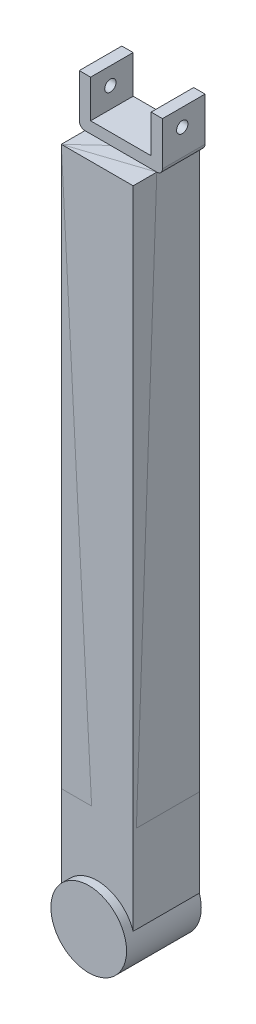
ISO-10303-21;
HEADER;
FILE_DESCRIPTION(('STEP AP214'),'2;1');
FILE_NAME('part.step','',(''),(''),'','','');
FILE_SCHEMA(('AUTOMOTIVE_DESIGN { 1 0 10303 214 1 1 1 1 }'));
ENDSEC;
DATA;
#1=APPLICATION_CONTEXT('core data for automotive mechanical design processes');
#2=APPLICATION_PROTOCOL_DEFINITION('international standard','automotive_design',2000,#1);
#3=PRODUCT_CONTEXT('',#1,'mechanical');
#4=PRODUCT('Part','Part','',(#3));
#5=PRODUCT_RELATED_PRODUCT_CATEGORY('part','',(#4));
#6=PRODUCT_DEFINITION_FORMATION('','',#4);
#7=PRODUCT_DEFINITION_CONTEXT('part definition',#1,'design');
#8=PRODUCT_DEFINITION('design','',#6,#7);
#9=PRODUCT_DEFINITION_SHAPE('','',#8);
#10=(LENGTH_UNIT() NAMED_UNIT(*) SI_UNIT(.MILLI.,.METRE.));
#11=(NAMED_UNIT(*) PLANE_ANGLE_UNIT() SI_UNIT($,.RADIAN.));
#12=(NAMED_UNIT(*) SI_UNIT($,.STERADIAN.) SOLID_ANGLE_UNIT());
#13=UNCERTAINTY_MEASURE_WITH_UNIT(LENGTH_MEASURE(1.E-05),#10,'distance_accuracy_value','');
#14=(GEOMETRIC_REPRESENTATION_CONTEXT(3) GLOBAL_UNCERTAINTY_ASSIGNED_CONTEXT((#13)) GLOBAL_UNIT_ASSIGNED_CONTEXT((#10,
#11,#12)) REPRESENTATION_CONTEXT('',''));
#15=CARTESIAN_POINT('',(0.,0.,0.));
#16=DIRECTION('',(0.,0.,1.));
#17=DIRECTION('',(1.,0.,0.));
#18=AXIS2_PLACEMENT_3D('',#15,#16,#17);
#19=CARTESIAN_POINT('',(-16.,6.,5.));
#20=DIRECTION('',(-1.,0.,0.));
#21=DIRECTION('',(0.,0.,1.));
#22=AXIS2_PLACEMENT_3D('',#19,#20,#21);
#23=PLANE('',#22);
#24=DIRECTION('',(0.,0.,-1.));
#25=VECTOR('',#24,1.);
#26=CARTESIAN_POINT('',(-16.,6.,5.));
#27=LINE('',#26,#25);
#28=CARTESIAN_POINT('',(-16.,6.,5.));
#29=VERTEX_POINT('',#28);
#30=CARTESIAN_POINT('',(-16.,6.,-17.5));
#31=VERTEX_POINT('',#30);
#32=EDGE_CURVE('E55',#29,#31,#27,.T.);
#33=ORIENTED_EDGE('',*,*,#32,.T.);
#34=DIRECTION('',(0.,1.,0.));
#35=VECTOR('',#34,1.);
#36=CARTESIAN_POINT('',(-16.,6.,-17.5));
#37=LINE('',#36,#35);
#38=CARTESIAN_POINT('',(-16.,26.,-17.5));
#39=VERTEX_POINT('',#38);
#40=EDGE_CURVE('E181',#31,#39,#37,.T.);
#41=ORIENTED_EDGE('',*,*,#40,.T.);
#42=DIRECTION('',(0.,0.,-1.));
#43=VECTOR('',#42,1.);
#44=CARTESIAN_POINT('',(-16.,26.,5.));
#45=LINE('',#44,#43);
#46=CARTESIAN_POINT('',(-16.,26.,5.));
#47=VERTEX_POINT('',#46);
#48=EDGE_CURVE('E238',#47,#39,#45,.T.);
#49=ORIENTED_EDGE('',*,*,#48,.F.);
#50=DIRECTION('',(0.,1.,0.));
#51=VECTOR('',#50,1.);
#52=CARTESIAN_POINT('',(-16.,6.,5.));
#53=LINE('',#52,#51);
#54=EDGE_CURVE('E205',#29,#47,#53,.T.);
#55=ORIENTED_EDGE('',*,*,#54,.F.);
#56=EDGE_LOOP('',(#33,#41,#49,#55));
#57=FACE_BOUND('',#56,.T.);
#58=CARTESIAN_POINT('',(-16.,16.8963252301986,-5.46063236981809));
#59=DIRECTION('',(-1.,0.,0.));
#60=DIRECTION('',(0.,0.,1.));
#61=AXIS2_PLACEMENT_3D('',#58,#59,#60);
#62=CIRCLE('',#61,3.);
#63=CARTESIAN_POINT('',(-16.,16.8963252301986,-2.46063236981809));
#64=VERTEX_POINT('',#63);
#65=EDGE_CURVE('E161',#64,#64,#62,.T.);
#66=ORIENTED_EDGE('',*,*,#65,.T.);
#67=EDGE_LOOP('',(#66));
#68=FACE_BOUND('',#67,.T.);
#69=ADVANCED_FACE('F47',(#57,#68),#23,.F.);
#70=CARTESIAN_POINT('',(-22.,3.00000000000002,5.));
#71=DIRECTION('',(1.,0.,0.));
#72=DIRECTION('',(0.,0.,-1.));
#73=AXIS2_PLACEMENT_3D('',#70,#71,#72);
#74=PLANE('',#73);
#75=DIRECTION('',(0.,0.,-1.));
#76=VECTOR('',#75,1.);
#77=CARTESIAN_POINT('',(-22.,26.,5.));
#78=LINE('',#77,#76);
#79=CARTESIAN_POINT('',(-22.,26.,5.));
#80=VERTEX_POINT('',#79);
#81=CARTESIAN_POINT('',(-22.,26.,-17.5));
#82=VERTEX_POINT('',#81);
#83=EDGE_CURVE('E236',#80,#82,#78,.T.);
#84=ORIENTED_EDGE('',*,*,#83,.T.);
#85=DIRECTION('',(0.,-1.,0.));
#86=VECTOR('',#85,1.);
#87=CARTESIAN_POINT('',(-22.,3.00000000000002,-17.5));
#88=LINE('',#87,#86);
#89=CARTESIAN_POINT('',(-22.,3.00000000000002,-17.5));
#90=VERTEX_POINT('',#89);
#91=EDGE_CURVE('E187',#82,#90,#88,.T.);
#92=ORIENTED_EDGE('',*,*,#91,.T.);
#93=DIRECTION('',(0.,0.,-1.));
#94=VECTOR('',#93,1.);
#95=CARTESIAN_POINT('',(-22.,3.00000000000002,5.));
#96=LINE('',#95,#94);
#97=CARTESIAN_POINT('',(-22.,3.00000000000002,5.));
#98=VERTEX_POINT('',#97);
#99=EDGE_CURVE('E234',#98,#90,#96,.T.);
#100=ORIENTED_EDGE('',*,*,#99,.F.);
#101=DIRECTION('',(0.,-1.,0.));
#102=VECTOR('',#101,1.);
#103=CARTESIAN_POINT('',(-22.,3.00000000000002,5.));
#104=LINE('',#103,#102);
#105=EDGE_CURVE('E209',#80,#98,#104,.T.);
#106=ORIENTED_EDGE('',*,*,#105,.F.);
#107=EDGE_LOOP('',(#84,#92,#100,#106));
#108=FACE_BOUND('',#107,.T.);
#109=CARTESIAN_POINT('',(-22.,16.8963252301986,-5.46063236981809));
#110=DIRECTION('',(-1.,0.,0.));
#111=DIRECTION('',(0.,0.,1.));
#112=AXIS2_PLACEMENT_3D('',#109,#110,#111);
#113=CIRCLE('',#112,3.);
#114=CARTESIAN_POINT('',(-22.,16.8963252301986,-2.46063236981809));
#115=VERTEX_POINT('',#114);
#116=EDGE_CURVE('E286',#115,#115,#113,.T.);
#117=ORIENTED_EDGE('',*,*,#116,.F.);
#118=EDGE_LOOP('',(#117));
#119=FACE_BOUND('',#118,.T.);
#120=ADVANCED_FACE('F306',(#108,#119),#74,.F.);
#121=CARTESIAN_POINT('',(-16.,6.,5.));
#122=DIRECTION('',(0.,-1.,0.));
#123=DIRECTION('',(0.,0.,-1.));
#124=AXIS2_PLACEMENT_3D('',#121,#122,#123);
#125=PLANE('',#124);
#126=DIRECTION('',(0.,0.,-1.));
#127=VECTOR('',#126,1.);
#128=CARTESIAN_POINT('',(16.,6.,5.));
#129=LINE('',#128,#127);
#130=CARTESIAN_POINT('',(16.,6.,5.));
#131=VERTEX_POINT('',#130);
#132=CARTESIAN_POINT('',(16.,6.,-17.5));
#133=VERTEX_POINT('',#132);
#134=EDGE_CURVE('E221',#131,#133,#129,.T.);
#135=ORIENTED_EDGE('',*,*,#134,.T.);
#136=DIRECTION('',(-1.,0.,0.));
#137=VECTOR('',#136,1.);
#138=CARTESIAN_POINT('',(-16.,6.,-17.5));
#139=LINE('',#138,#137);
#140=EDGE_CURVE('E178',#133,#31,#139,.T.);
#141=ORIENTED_EDGE('',*,*,#140,.T.);
#142=ORIENTED_EDGE('',*,*,#32,.F.);
#143=DIRECTION('',(-1.,0.,0.));
#144=VECTOR('',#143,1.);
#145=CARTESIAN_POINT('',(-16.,6.,5.));
#146=LINE('',#145,#144);
#147=EDGE_CURVE('E203',#131,#29,#146,.T.);
#148=ORIENTED_EDGE('',*,*,#147,.F.);
#149=EDGE_LOOP('',(#135,#141,#142,#148));
#150=FACE_BOUND('',#149,.T.);
#151=ADVANCED_FACE('F49',(#150),#125,.F.);
#152=CARTESIAN_POINT('',(-16.,26.,5.));
#153=DIRECTION('',(0.,-1.,0.));
#154=DIRECTION('',(0.,0.,-1.));
#155=AXIS2_PLACEMENT_3D('',#152,#153,#154);
#156=PLANE('',#155);
#157=ORIENTED_EDGE('',*,*,#48,.T.);
#158=DIRECTION('',(-1.,0.,0.));
#159=VECTOR('',#158,1.);
#160=CARTESIAN_POINT('',(-16.,26.,-17.5));
#161=LINE('',#160,#159);
#162=EDGE_CURVE('E184',#39,#82,#161,.T.);
#163=ORIENTED_EDGE('',*,*,#162,.T.);
#164=ORIENTED_EDGE('',*,*,#83,.F.);
#165=DIRECTION('',(-1.,0.,0.));
#166=VECTOR('',#165,1.);
#167=CARTESIAN_POINT('',(-16.,26.,5.));
#168=LINE('',#167,#166);
#169=EDGE_CURVE('E207',#47,#80,#168,.T.);
#170=ORIENTED_EDGE('',*,*,#169,.F.);
#171=EDGE_LOOP('',(#157,#163,#164,#170));
#172=FACE_BOUND('',#171,.T.);
#173=ADVANCED_FACE('F313',(#172),#156,.F.);
#174=CARTESIAN_POINT('',(-19.,3.,5.));
#175=DIRECTION('',(0.,0.,-1.));
#176=DIRECTION('',(-1.,0.,0.));
#177=AXIS2_PLACEMENT_3D('',#174,#175,#176);
#178=CYLINDRICAL_SURFACE('',#177,3.);
#179=ORIENTED_EDGE('',*,*,#99,.T.);
#180=CARTESIAN_POINT('',(-19.,3.,-17.5));
#181=DIRECTION('',(0.,0.,1.));
#182=DIRECTION('',(-1.,0.,0.));
#183=AXIS2_PLACEMENT_3D('',#180,#181,#182);
#184=CIRCLE('',#183,3.);
#185=CARTESIAN_POINT('',(-19.,0.,-17.5));
#186=VERTEX_POINT('',#185);
#187=EDGE_CURVE('E190',#90,#186,#184,.T.);
#188=ORIENTED_EDGE('',*,*,#187,.T.);
#189=DIRECTION('',(0.,0.,-1.));
#190=VECTOR('',#189,1.);
#191=CARTESIAN_POINT('',(-19.,0.,5.));
#192=LINE('',#191,#190);
#193=CARTESIAN_POINT('',(-19.,0.,5.));
#194=VERTEX_POINT('',#193);
#195=EDGE_CURVE('E231',#194,#186,#192,.T.);
#196=ORIENTED_EDGE('',*,*,#195,.F.);
#197=CARTESIAN_POINT('',(-19.,3.,5.));
#198=DIRECTION('',(0.,0.,1.));
#199=DIRECTION('',(-1.,0.,0.));
#200=AXIS2_PLACEMENT_3D('',#197,#198,#199);
#201=CIRCLE('',#200,3.);
#202=EDGE_CURVE('E211',#98,#194,#201,.T.);
#203=ORIENTED_EDGE('',*,*,#202,.F.);
#204=EDGE_LOOP('',(#179,#188,#196,#203));
#205=FACE_BOUND('',#204,.T.);
#206=ADVANCED_FACE('F315',(#205),#178,.T.);
#207=CARTESIAN_POINT('',(19.,3.,5.));
#208=DIRECTION('',(0.,0.,-1.));
#209=DIRECTION('',(-1.,0.,0.));
#210=AXIS2_PLACEMENT_3D('',#207,#208,#209);
#211=CYLINDRICAL_SURFACE('',#210,3.);
#212=DIRECTION('',(0.,0.,-1.));
#213=VECTOR('',#212,1.);
#214=CARTESIAN_POINT('',(19.,0.,5.));
#215=LINE('',#214,#213);
#216=CARTESIAN_POINT('',(19.,0.,5.));
#217=VERTEX_POINT('',#216);
#218=CARTESIAN_POINT('',(19.,0.,-17.5));
#219=VERTEX_POINT('',#218);
#220=EDGE_CURVE('E229',#217,#219,#215,.T.);
#221=ORIENTED_EDGE('',*,*,#220,.T.);
#222=CARTESIAN_POINT('',(19.,3.,-17.5));
#223=DIRECTION('',(0.,0.,1.));
#224=DIRECTION('',(1.,0.,0.));
#225=AXIS2_PLACEMENT_3D('',#222,#223,#224);
#226=CIRCLE('',#225,3.);
#227=CARTESIAN_POINT('',(22.,3.00000000000002,-17.5));
#228=VERTEX_POINT('',#227);
#229=EDGE_CURVE('E166',#219,#228,#226,.T.);
#230=ORIENTED_EDGE('',*,*,#229,.T.);
#231=DIRECTION('',(0.,0.,-1.));
#232=VECTOR('',#231,1.);
#233=CARTESIAN_POINT('',(22.,3.00000000000002,5.));
#234=LINE('',#233,#232);
#235=CARTESIAN_POINT('',(22.,3.00000000000002,5.));
#236=VERTEX_POINT('',#235);
#237=EDGE_CURVE('E227',#236,#228,#234,.T.);
#238=ORIENTED_EDGE('',*,*,#237,.F.);
#239=CARTESIAN_POINT('',(19.,3.,5.));
#240=DIRECTION('',(0.,0.,1.));
#241=DIRECTION('',(1.,0.,0.));
#242=AXIS2_PLACEMENT_3D('',#239,#240,#241);
#243=CIRCLE('',#242,3.);
#244=EDGE_CURVE('E215',#217,#236,#243,.T.);
#245=ORIENTED_EDGE('',*,*,#244,.F.);
#246=EDGE_LOOP('',(#221,#230,#238,#245));
#247=FACE_BOUND('',#246,.T.);
#248=ADVANCED_FACE('F261',(#247),#211,.T.);
#249=CARTESIAN_POINT('',(22.,3.00000000000002,5.));
#250=DIRECTION('',(-1.,0.,0.));
#251=DIRECTION('',(0.,0.,1.));
#252=AXIS2_PLACEMENT_3D('',#249,#250,#251);
#253=PLANE('',#252);
#254=CARTESIAN_POINT('',(22.,16.8963252301986,-5.46063236981809));
#255=DIRECTION('',(-1.,0.,0.));
#256=DIRECTION('',(0.,0.,1.));
#257=AXIS2_PLACEMENT_3D('',#254,#255,#256);
#258=CIRCLE('',#257,3.);
#259=CARTESIAN_POINT('',(22.,16.8963252301986,-2.46063236981809));
#260=VERTEX_POINT('',#259);
#261=EDGE_CURVE('E270',#260,#260,#258,.T.);
#262=ORIENTED_EDGE('',*,*,#261,.T.);
#263=EDGE_LOOP('',(#262));
#264=FACE_BOUND('',#263,.T.);
#265=ORIENTED_EDGE('',*,*,#237,.T.);
#266=DIRECTION('',(0.,1.,0.));
#267=VECTOR('',#266,1.);
#268=CARTESIAN_POINT('',(22.,3.00000000000002,-17.5));
#269=LINE('',#268,#267);
#270=CARTESIAN_POINT('',(22.,26.,-17.5));
#271=VERTEX_POINT('',#270);
#272=EDGE_CURVE('E194',#228,#271,#269,.T.);
#273=ORIENTED_EDGE('',*,*,#272,.T.);
#274=DIRECTION('',(0.,0.,-1.));
#275=VECTOR('',#274,1.);
#276=CARTESIAN_POINT('',(22.,26.,5.));
#277=LINE('',#276,#275);
#278=CARTESIAN_POINT('',(22.,26.,5.));
#279=VERTEX_POINT('',#278);
#280=EDGE_CURVE('E225',#279,#271,#277,.T.);
#281=ORIENTED_EDGE('',*,*,#280,.F.);
#282=DIRECTION('',(0.,1.,0.));
#283=VECTOR('',#282,1.);
#284=CARTESIAN_POINT('',(22.,3.00000000000002,5.));
#285=LINE('',#284,#283);
#286=EDGE_CURVE('E217',#236,#279,#285,.T.);
#287=ORIENTED_EDGE('',*,*,#286,.F.);
#288=EDGE_LOOP('',(#265,#273,#281,#287));
#289=FACE_BOUND('',#288,.T.);
#290=ADVANCED_FACE('F256',(#264,#289),#253,.F.);
#291=CARTESIAN_POINT('',(16.,26.,5.));
#292=DIRECTION('',(0.,-1.,0.));
#293=DIRECTION('',(0.,0.,-1.));
#294=AXIS2_PLACEMENT_3D('',#291,#292,#293);
#295=PLANE('',#294);
#296=ORIENTED_EDGE('',*,*,#280,.T.);
#297=DIRECTION('',(-1.,0.,0.));
#298=VECTOR('',#297,1.);
#299=CARTESIAN_POINT('',(16.,26.,-17.5));
#300=LINE('',#299,#298);
#301=CARTESIAN_POINT('',(16.,26.,-17.5));
#302=VERTEX_POINT('',#301);
#303=EDGE_CURVE('E197',#271,#302,#300,.T.);
#304=ORIENTED_EDGE('',*,*,#303,.T.);
#305=DIRECTION('',(0.,0.,-1.));
#306=VECTOR('',#305,1.);
#307=CARTESIAN_POINT('',(16.,26.,5.));
#308=LINE('',#307,#306);
#309=CARTESIAN_POINT('',(16.,26.,5.));
#310=VERTEX_POINT('',#309);
#311=EDGE_CURVE('E223',#310,#302,#308,.T.);
#312=ORIENTED_EDGE('',*,*,#311,.F.);
#313=DIRECTION('',(-1.,0.,0.));
#314=VECTOR('',#313,1.);
#315=CARTESIAN_POINT('',(16.,26.,5.));
#316=LINE('',#315,#314);
#317=EDGE_CURVE('E67',#279,#310,#316,.T.);
#318=ORIENTED_EDGE('',*,*,#317,.F.);
#319=EDGE_LOOP('',(#296,#304,#312,#318));
#320=FACE_BOUND('',#319,.T.);
#321=ADVANCED_FACE('F325',(#320),#295,.F.);
#322=CARTESIAN_POINT('',(16.,6.,5.));
#323=DIRECTION('',(1.,0.,0.));
#324=DIRECTION('',(0.,1.,0.));
#325=AXIS2_PLACEMENT_3D('',#322,#323,#324);
#326=PLANE('',#325);
#327=CARTESIAN_POINT('',(16.,16.8963252301986,-5.46063236981809));
#328=DIRECTION('',(-1.,0.,0.));
#329=DIRECTION('',(0.,0.,1.));
#330=AXIS2_PLACEMENT_3D('',#327,#328,#329);
#331=CIRCLE('',#330,3.);
#332=CARTESIAN_POINT('',(16.,16.8963252301986,-2.46063236981809));
#333=VERTEX_POINT('',#332);
#334=EDGE_CURVE('E274',#333,#333,#331,.T.);
#335=ORIENTED_EDGE('',*,*,#334,.F.);
#336=EDGE_LOOP('',(#335));
#337=FACE_BOUND('',#336,.T.);
#338=ORIENTED_EDGE('',*,*,#311,.T.);
#339=DIRECTION('',(0.,-1.,0.));
#340=VECTOR('',#339,1.);
#341=CARTESIAN_POINT('',(16.,6.,-17.5));
#342=LINE('',#341,#340);
#343=EDGE_CURVE('E200',#302,#133,#342,.T.);
#344=ORIENTED_EDGE('',*,*,#343,.T.);
#345=ORIENTED_EDGE('',*,*,#134,.F.);
#346=DIRECTION('',(0.,-1.,0.));
#347=VECTOR('',#346,1.);
#348=CARTESIAN_POINT('',(16.,6.,5.));
#349=LINE('',#348,#347);
#350=EDGE_CURVE('E62',#310,#131,#349,.T.);
#351=ORIENTED_EDGE('',*,*,#350,.F.);
#352=EDGE_LOOP('',(#338,#344,#345,#351));
#353=FACE_BOUND('',#352,.T.);
#354=ADVANCED_FACE('F251',(#337,#353),#326,.F.);
#355=CARTESIAN_POINT('',(19.,3.,5.));
#356=DIRECTION('',(0.,0.,1.));
#357=DIRECTION('',(1.,0.,0.));
#358=AXIS2_PLACEMENT_3D('',#355,#356,#357);
#359=PLANE('',#358);
#360=ORIENTED_EDGE('',*,*,#147,.T.);
#361=ORIENTED_EDGE('',*,*,#54,.T.);
#362=ORIENTED_EDGE('',*,*,#169,.T.);
#363=ORIENTED_EDGE('',*,*,#105,.T.);
#364=ORIENTED_EDGE('',*,*,#202,.T.);
#365=DIRECTION('',(1.,0.,0.));
#366=VECTOR('',#365,1.);
#367=CARTESIAN_POINT('',(-19.,0.,5.));
#368=LINE('',#367,#366);
#369=EDGE_CURVE('E213',#194,#217,#368,.T.);
#370=ORIENTED_EDGE('',*,*,#369,.T.);
#371=ORIENTED_EDGE('',*,*,#244,.T.);
#372=ORIENTED_EDGE('',*,*,#286,.T.);
#373=ORIENTED_EDGE('',*,*,#317,.T.);
#374=ORIENTED_EDGE('',*,*,#350,.T.);
#375=EDGE_LOOP('',(#360,#361,#362,#363,#364,#370,#371,#372,#373,#374));
#376=FACE_BOUND('',#375,.T.);
#377=ADVANCED_FACE('F331',(#376),#359,.T.);
#378=CARTESIAN_POINT('',(19.,3.,-17.5));
#379=DIRECTION('',(0.,0.,1.));
#380=DIRECTION('',(1.,0.,0.));
#381=AXIS2_PLACEMENT_3D('',#378,#379,#380);
#382=PLANE('',#381);
#383=DIRECTION('',(0.,1.,0.));
#384=VECTOR('',#383,1.);
#385=CARTESIAN_POINT('',(19.,-348.59,-17.5));
#386=LINE('',#385,#384);
#387=CARTESIAN_POINT('',(19.,-341.358676771403,-17.5));
#388=VERTEX_POINT('',#387);
#389=EDGE_CURVE('E157',#388,#219,#386,.T.);
#390=ORIENTED_EDGE('',*,*,#389,.F.);
#391=CARTESIAN_POINT('',(0.,-347.603674769801,-17.5));
#392=DIRECTION('',(0.,0.,1.));
#393=DIRECTION('',(1.,0.,0.));
#394=AXIS2_PLACEMENT_3D('',#391,#392,#393);
#395=CIRCLE('',#394,20.);
#396=CARTESIAN_POINT('',(-19.,-341.358676771403,-17.5));
#397=VERTEX_POINT('',#396);
#398=EDGE_CURVE('E140',#397,#388,#395,.T.);
#399=ORIENTED_EDGE('',*,*,#398,.F.);
#400=DIRECTION('',(0.,1.,0.));
#401=VECTOR('',#400,1.);
#402=CARTESIAN_POINT('',(-19.,-348.59,-17.5));
#403=LINE('',#402,#401);
#404=EDGE_CURVE('E168',#397,#186,#403,.T.);
#405=ORIENTED_EDGE('',*,*,#404,.T.);
#406=ORIENTED_EDGE('',*,*,#187,.F.);
#407=ORIENTED_EDGE('',*,*,#91,.F.);
#408=ORIENTED_EDGE('',*,*,#162,.F.);
#409=ORIENTED_EDGE('',*,*,#40,.F.);
#410=ORIENTED_EDGE('',*,*,#140,.F.);
#411=ORIENTED_EDGE('',*,*,#343,.F.);
#412=ORIENTED_EDGE('',*,*,#303,.F.);
#413=ORIENTED_EDGE('',*,*,#272,.F.);
#414=ORIENTED_EDGE('',*,*,#229,.F.);
#415=EDGE_LOOP('',(#390,#399,#405,#406,#407,#408,#409,#410,#411,#412,#413,#414));
#416=FACE_BOUND('',#415,.T.);
#417=ADVANCED_FACE('F163',(#416),#382,.F.);
#418=CARTESIAN_POINT('',(19.,-348.59,-17.5));
#419=DIRECTION('',(1.,0.,0.));
#420=DIRECTION('',(0.,0.,-1.));
#421=AXIS2_PLACEMENT_3D('',#418,#419,#420);
#422=PLANE('',#421);
#423=DIRECTION('',(0.,0.,1.));
#424=VECTOR('',#423,1.);
#425=CARTESIAN_POINT('',(19.,-341.358676771403,-17.5));
#426=LINE('',#425,#424);
#427=CARTESIAN_POINT('',(19.0000000000001,-341.358676771403,17.5));
#428=VERTEX_POINT('',#427);
#429=EDGE_CURVE('E144',#388,#428,#426,.T.);
#430=ORIENTED_EDGE('',*,*,#429,.F.);
#431=ORIENTED_EDGE('',*,*,#389,.T.);
#432=ORIENTED_EDGE('',*,*,#220,.F.);
#433=DIRECTION('',(0.,0.,-1.));
#434=VECTOR('',#433,1.);
#435=CARTESIAN_POINT('',(19.,0.,-17.5));
#436=LINE('',#435,#434);
#437=CARTESIAN_POINT('',(19.0000000000001,0.,17.5));
#438=VERTEX_POINT('',#437);
#439=EDGE_CURVE('E263',#438,#217,#436,.T.);
#440=ORIENTED_EDGE('',*,*,#439,.F.);
#441=DIRECTION('',(0.,1.,0.));
#442=VECTOR('',#441,1.);
#443=CARTESIAN_POINT('',(19.0000000000001,-348.59,17.5));
#444=LINE('',#443,#442);
#445=EDGE_CURVE('E160',#428,#438,#444,.T.);
#446=ORIENTED_EDGE('',*,*,#445,.F.);
#447=EDGE_LOOP('',(#430,#431,#432,#440,#446));
#448=FACE_BOUND('',#447,.T.);
#449=ADVANCED_FACE('F155',(#448),#422,.T.);
#450=CARTESIAN_POINT('',(-18.9999999999999,-348.59,17.5));
#451=DIRECTION('',(0.,0.,1.));
#452=DIRECTION('',(1.,0.,0.));
#453=AXIS2_PLACEMENT_3D('',#450,#451,#452);
#454=PLANE('',#453);
#455=CARTESIAN_POINT('',(0.,-347.603674769801,17.5));
#456=DIRECTION('',(0.,0.,1.));
#457=DIRECTION('',(1.,0.,0.));
#458=AXIS2_PLACEMENT_3D('',#455,#456,#457);
#459=CIRCLE('',#458,20.);
#460=CARTESIAN_POINT('',(-19.,-341.358676771403,17.5));
#461=VERTEX_POINT('',#460);
#462=EDGE_CURVE('E150',#428,#461,#459,.T.);
#463=ORIENTED_EDGE('',*,*,#462,.F.);
#464=ORIENTED_EDGE('',*,*,#445,.T.);
#465=DIRECTION('',(1.,0.,0.));
#466=VECTOR('',#465,1.);
#467=CARTESIAN_POINT('',(-18.9999999999999,0.,17.5));
#468=LINE('',#467,#466);
#469=CARTESIAN_POINT('',(-18.9999999999999,0.,17.5));
#470=VERTEX_POINT('',#469);
#471=EDGE_CURVE('E169',#470,#438,#468,.T.);
#472=ORIENTED_EDGE('',*,*,#471,.F.);
#473=DIRECTION('',(0.,1.,0.));
#474=VECTOR('',#473,1.);
#475=CARTESIAN_POINT('',(-18.9999999999999,-348.59,17.5));
#476=LINE('',#475,#474);
#477=EDGE_CURVE('E171',#461,#470,#476,.T.);
#478=ORIENTED_EDGE('',*,*,#477,.F.);
#479=EDGE_LOOP('',(#463,#464,#472,#478));
#480=FACE_BOUND('',#479,.T.);
#481=ADVANCED_FACE('F282',(#480),#454,.T.);
#482=CARTESIAN_POINT('',(-19.,-348.59,-17.5));
#483=DIRECTION('',(-1.,0.,0.));
#484=DIRECTION('',(0.,0.,1.));
#485=AXIS2_PLACEMENT_3D('',#482,#483,#484);
#486=PLANE('',#485);
#487=CARTESIAN_POINT('',(-19.,-85.,-5.46063236981807));
#488=DIRECTION('',(-1.,0.,0.));
#489=DIRECTION('',(0.,0.,1.));
#490=AXIS2_PLACEMENT_3D('',#487,#488,#489);
#491=CIRCLE('',#490,5.00000000000001);
#492=CARTESIAN_POINT('',(-19.,-85.,-0.460632369818067));
#493=VERTEX_POINT('',#492);
#494=EDGE_CURVE('E438',#493,#493,#491,.T.);
#495=ORIENTED_EDGE('',*,*,#494,.F.);
#496=EDGE_LOOP('',(#495));
#497=FACE_BOUND('',#496,.T.);
#498=DIRECTION('',(0.,0.,1.));
#499=VECTOR('',#498,1.);
#500=CARTESIAN_POINT('',(-19.,-341.358676771403,-17.5));
#501=LINE('',#500,#499);
#502=EDGE_CURVE('E12',#461,#397,#501,.F.);
#503=ORIENTED_EDGE('',*,*,#502,.F.);
#504=ORIENTED_EDGE('',*,*,#477,.T.);
#505=DIRECTION('',(0.,0.,1.));
#506=VECTOR('',#505,1.);
#507=CARTESIAN_POINT('',(-19.,0.,-17.5));
#508=LINE('',#507,#506);
#509=EDGE_CURVE('E174',#194,#470,#508,.T.);
#510=ORIENTED_EDGE('',*,*,#509,.F.);
#511=ORIENTED_EDGE('',*,*,#195,.T.);
#512=ORIENTED_EDGE('',*,*,#404,.F.);
#513=EDGE_LOOP('',(#503,#504,#510,#511,#512));
#514=FACE_BOUND('',#513,.T.);
#515=ADVANCED_FACE('F280',(#497,#514),#486,.T.);
#516=CARTESIAN_POINT('',(0.,0.,0.));
#517=DIRECTION('',(0.,1.,0.));
#518=DIRECTION('',(0.,0.,1.));
#519=AXIS2_PLACEMENT_3D('',#516,#517,#518);
#520=PLANE('',#519);
#521=ORIENTED_EDGE('',*,*,#439,.T.);
#522=ORIENTED_EDGE('',*,*,#369,.F.);
#523=ORIENTED_EDGE('',*,*,#509,.T.);
#524=ORIENTED_EDGE('',*,*,#471,.T.);
#525=EDGE_LOOP('',(#521,#522,#523,#524));
#526=FACE_BOUND('',#525,.T.);
#527=ADVANCED_FACE('F266',(#526),#520,.T.);
#528=CARTESIAN_POINT('',(22.,16.8963252301986,-5.46063236981809));
#529=DIRECTION('',(-1.,0.,0.));
#530=DIRECTION('',(0.,0.,1.));
#531=AXIS2_PLACEMENT_3D('',#528,#529,#530);
#532=CYLINDRICAL_SURFACE('',#531,3.);
#533=ORIENTED_EDGE('',*,*,#261,.F.);
#534=EDGE_LOOP('',(#533));
#535=FACE_BOUND('',#534,.T.);
#536=ORIENTED_EDGE('',*,*,#334,.T.);
#537=EDGE_LOOP('',(#536));
#538=FACE_BOUND('',#537,.T.);
#539=ADVANCED_FACE('F294',(#535,#538),#532,.F.);
#540=CARTESIAN_POINT('',(-22.,16.8963252301986,-5.46063236981809));
#541=DIRECTION('',(1.,0.,0.));
#542=DIRECTION('',(0.,0.,-1.));
#543=AXIS2_PLACEMENT_3D('',#540,#541,#542);
#544=CYLINDRICAL_SURFACE('',#543,3.);
#545=ORIENTED_EDGE('',*,*,#116,.T.);
#546=EDGE_LOOP('',(#545));
#547=FACE_BOUND('',#546,.T.);
#548=ORIENTED_EDGE('',*,*,#65,.F.);
#549=EDGE_LOOP('',(#548));
#550=FACE_BOUND('',#549,.T.);
#551=ADVANCED_FACE('F292',(#547,#550),#544,.F.);
#552=CARTESIAN_POINT('',(0.,-347.603674769801,-17.5));
#553=DIRECTION('',(0.,0.,1.));
#554=DIRECTION('',(1.,0.,0.));
#555=AXIS2_PLACEMENT_3D('',#552,#553,#554);
#556=CYLINDRICAL_SURFACE('',#555,20.);
#557=ORIENTED_EDGE('',*,*,#398,.T.);
#558=ORIENTED_EDGE('',*,*,#429,.T.);
#559=ORIENTED_EDGE('',*,*,#462,.T.);
#560=ORIENTED_EDGE('',*,*,#502,.T.);
#561=EDGE_LOOP('',(#557,#558,#559,#560));
#562=FACE_BOUND('',#561,.T.);
#563=CARTESIAN_POINT('',(0.,-347.603674769801,22.));
#564=DIRECTION('',(0.,0.,1.));
#565=DIRECTION('',(1.,0.,0.));
#566=AXIS2_PLACEMENT_3D('',#563,#564,#565);
#567=CIRCLE('',#566,20.);
#568=CARTESIAN_POINT('',(20.,-347.603674769801,22.));
#569=VERTEX_POINT('',#568);
#570=EDGE_CURVE('E151',#569,#569,#567,.T.);
#571=ORIENTED_EDGE('',*,*,#570,.F.);
#572=EDGE_LOOP('',(#571));
#573=FACE_BOUND('',#572,.T.);
#574=ADVANCED_FACE('F142',(#562,#573),#556,.T.);
#575=CARTESIAN_POINT('',(0.,-347.603674769801,22.));
#576=DIRECTION('',(0.,0.,1.));
#577=DIRECTION('',(1.,0.,0.));
#578=AXIS2_PLACEMENT_3D('',#575,#576,#577);
#579=PLANE('',#578);
#580=ORIENTED_EDGE('',*,*,#570,.T.);
#581=EDGE_LOOP('',(#580));
#582=FACE_BOUND('',#581,.T.);
#583=ADVANCED_FACE('F301',(#582),#579,.T.);
#584=CARTESIAN_POINT('',(-8.99999999999996,-85.,-5.46063236981808));
#585=DIRECTION('',(-1.,0.,0.));
#586=DIRECTION('',(0.,0.,1.));
#587=AXIS2_PLACEMENT_3D('',#584,#585,#586);
#588=CYLINDRICAL_SURFACE('',#587,5.00000000000001);
#589=CARTESIAN_POINT('',(-8.99999999999996,-85.,-5.46063236981808));
#590=DIRECTION('',(-1.,0.,0.));
#591=DIRECTION('',(0.,0.,1.));
#592=AXIS2_PLACEMENT_3D('',#589,#590,#591);
#593=CIRCLE('',#592,5.00000000000001);
#594=CARTESIAN_POINT('',(-8.99999999999996,-85.,-0.460632369818071));
#595=VERTEX_POINT('',#594);
#596=EDGE_CURVE('E437',#595,#595,#593,.T.);
#597=ORIENTED_EDGE('',*,*,#596,.F.);
#598=EDGE_LOOP('',(#597));
#599=FACE_BOUND('',#598,.T.);
#600=ORIENTED_EDGE('',*,*,#494,.T.);
#601=EDGE_LOOP('',(#600));
#602=FACE_BOUND('',#601,.T.);
#603=ADVANCED_FACE('F407',(#599,#602),#588,.F.);
#604=CARTESIAN_POINT('',(-8.99999999999996,-85.,-5.46063236981808));
#605=DIRECTION('',(-1.,0.,0.));
#606=DIRECTION('',(0.,0.,1.));
#607=AXIS2_PLACEMENT_3D('',#604,#605,#606);
#608=PLANE('',#607);
#609=ORIENTED_EDGE('',*,*,#596,.T.);
#610=EDGE_LOOP('',(#609));
#611=FACE_BOUND('',#610,.T.);
#612=ADVANCED_FACE('F421',(#611),#608,.T.);
#613=CLOSED_SHELL('',(#69,#120,#151,#173,#206,#248,#290,#321,#354,#377,#417,#449,#481,#515,#527,
#539,#551,#574,#583,#603,#612));
#614=MANIFOLD_SOLID_BREP('B2',#613);
#615=CARTESIAN_POINT('',(19.,-295.,-17.5));
#616=DIRECTION('',(1.,0.,0.));
#617=DIRECTION('',(0.,0.,-1.));
#618=AXIS2_PLACEMENT_3D('',#615,#616,#617);
#619=PLANE('',#618);
#620=DIRECTION('',(0.,0.,-1.));
#621=VECTOR('',#620,1.);
#622=CARTESIAN_POINT('',(19.,0.,-17.5));
#623=LINE('',#622,#621);
#624=CARTESIAN_POINT('',(19.0000000000001,0.,17.5));
#625=VERTEX_POINT('',#624);
#626=CARTESIAN_POINT('',(19.,0.,-17.5));
#627=VERTEX_POINT('',#626);
#628=EDGE_CURVE('E576',#625,#627,#623,.T.);
#629=ORIENTED_EDGE('',*,*,#628,.F.);
#630=DIRECTION('',(0.,1.,0.));
#631=VECTOR('',#630,1.);
#632=CARTESIAN_POINT('',(19.0000000000001,-295.,17.5));
#633=LINE('',#632,#631);
#634=CARTESIAN_POINT('',(19.0000000000001,-295.,17.5));
#635=VERTEX_POINT('',#634);
#636=EDGE_CURVE('E45',#635,#625,#633,.T.);
#637=ORIENTED_EDGE('',*,*,#636,.F.);
#638=DIRECTION('',(0.,0.,-1.));
#639=VECTOR('',#638,1.);
#640=CARTESIAN_POINT('',(19.,-295.,-17.5));
#641=LINE('',#640,#639);
#642=CARTESIAN_POINT('',(19.,-295.,-17.5));
#643=VERTEX_POINT('',#642);
#644=EDGE_CURVE('E570',#635,#643,#641,.T.);
#645=ORIENTED_EDGE('',*,*,#644,.T.);
#646=DIRECTION('',(0.,1.,0.));
#647=VECTOR('',#646,1.);
#648=CARTESIAN_POINT('',(19.,-295.,-17.5));
#649=LINE('',#648,#647);
#650=EDGE_CURVE('E515',#643,#627,#649,.T.);
#651=ORIENTED_EDGE('',*,*,#650,.T.);
#652=EDGE_LOOP('',(#629,#637,#645,#651));
#653=FACE_BOUND('',#652,.T.);
#654=ADVANCED_FACE('F512',(#653),#619,.T.);
#655=CARTESIAN_POINT('',(-18.9999999999999,-295.,17.5));
#656=DIRECTION('',(0.,0.,1.));
#657=DIRECTION('',(1.,0.,0.));
#658=AXIS2_PLACEMENT_3D('',#655,#656,#657);
#659=PLANE('',#658);
#660=DIRECTION('',(1.,0.,0.));
#661=VECTOR('',#660,1.);
#662=CARTESIAN_POINT('',(-18.9999999999999,0.,17.5));
#663=LINE('',#662,#661);
#664=CARTESIAN_POINT('',(-18.9999999999999,0.,17.5));
#665=VERTEX_POINT('',#664);
#666=EDGE_CURVE('E572',#665,#625,#663,.T.);
#667=ORIENTED_EDGE('',*,*,#666,.F.);
#668=DIRECTION('',(0.,1.,0.));
#669=VECTOR('',#668,1.);
#670=CARTESIAN_POINT('',(-18.9999999999999,-295.,17.5));
#671=LINE('',#670,#669);
#672=CARTESIAN_POINT('',(-18.9999999999999,-295.,17.5));
#673=VERTEX_POINT('',#672);
#674=EDGE_CURVE('E521',#673,#665,#671,.T.);
#675=ORIENTED_EDGE('',*,*,#674,.F.);
#676=DIRECTION('',(1.,0.,0.));
#677=VECTOR('',#676,1.);
#678=CARTESIAN_POINT('',(-18.9999999999999,-295.,17.5));
#679=LINE('',#678,#677);
#680=EDGE_CURVE('E567',#673,#635,#679,.T.);
#681=ORIENTED_EDGE('',*,*,#680,.T.);
#682=ORIENTED_EDGE('',*,*,#636,.T.);
#683=EDGE_LOOP('',(#667,#675,#681,#682));
#684=FACE_BOUND('',#683,.T.);
#685=ADVANCED_FACE('F586',(#684),#659,.T.);
#686=CARTESIAN_POINT('',(-19.,-295.,-17.5));
#687=DIRECTION('',(-1.,0.,0.));
#688=DIRECTION('',(0.,0.,1.));
#689=AXIS2_PLACEMENT_3D('',#686,#687,#688);
#690=PLANE('',#689);
#691=DIRECTION('',(0.,0.,1.));
#692=VECTOR('',#691,1.);
#693=CARTESIAN_POINT('',(-19.,0.,-17.5));
#694=LINE('',#693,#692);
#695=CARTESIAN_POINT('',(-19.,0.,-17.5));
#696=VERTEX_POINT('',#695);
#697=EDGE_CURVE('E562',#696,#665,#694,.T.);
#698=ORIENTED_EDGE('',*,*,#697,.F.);
#699=DIRECTION('',(0.,1.,0.));
#700=VECTOR('',#699,1.);
#701=CARTESIAN_POINT('',(-19.,-295.,-17.5));
#702=LINE('',#701,#700);
#703=CARTESIAN_POINT('',(-19.,-295.,-17.5));
#704=VERTEX_POINT('',#703);
#705=EDGE_CURVE('E557',#704,#696,#702,.T.);
#706=ORIENTED_EDGE('',*,*,#705,.F.);
#707=DIRECTION('',(0.,0.,1.));
#708=VECTOR('',#707,1.);
#709=CARTESIAN_POINT('',(-19.,-295.,-17.5));
#710=LINE('',#709,#708);
#711=EDGE_CURVE('E560',#704,#673,#710,.T.);
#712=ORIENTED_EDGE('',*,*,#711,.T.);
#713=ORIENTED_EDGE('',*,*,#674,.T.);
#714=EDGE_LOOP('',(#698,#706,#712,#713));
#715=FACE_BOUND('',#714,.T.);
#716=ADVANCED_FACE('F559',(#715),#690,.T.);
#717=CARTESIAN_POINT('',(-19.,-295.,-17.5));
#718=DIRECTION('',(0.,0.,-1.));
#719=DIRECTION('',(-1.,0.,0.));
#720=AXIS2_PLACEMENT_3D('',#717,#718,#719);
#721=PLANE('',#720);
#722=DIRECTION('',(-1.,0.,0.));
#723=VECTOR('',#722,1.);
#724=CARTESIAN_POINT('',(-19.,0.,-17.5));
#725=LINE('',#724,#723);
#726=EDGE_CURVE('E579',#627,#696,#725,.T.);
#727=ORIENTED_EDGE('',*,*,#726,.F.);
#728=ORIENTED_EDGE('',*,*,#650,.F.);
#729=DIRECTION('',(-1.,0.,0.));
#730=VECTOR('',#729,1.);
#731=CARTESIAN_POINT('',(-19.,-295.,-17.5));
#732=LINE('',#731,#730);
#733=EDGE_CURVE('E566',#643,#704,#732,.T.);
#734=ORIENTED_EDGE('',*,*,#733,.T.);
#735=ORIENTED_EDGE('',*,*,#705,.T.);
#736=EDGE_LOOP('',(#727,#728,#734,#735));
#737=FACE_BOUND('',#736,.T.);
#738=ADVANCED_FACE('F569',(#737),#721,.T.);
#739=CARTESIAN_POINT('',(0.,-295.,0.));
#740=DIRECTION('',(0.,1.,0.));
#741=DIRECTION('',(0.,0.,1.));
#742=AXIS2_PLACEMENT_3D('',#739,#740,#741);
#743=PLANE('',#742);
#744=ORIENTED_EDGE('',*,*,#644,.F.);
#745=ORIENTED_EDGE('',*,*,#680,.F.);
#746=ORIENTED_EDGE('',*,*,#711,.F.);
#747=ORIENTED_EDGE('',*,*,#733,.F.);
#748=EDGE_LOOP('',(#744,#745,#746,#747));
#749=FACE_BOUND('',#748,.T.);
#750=ADVANCED_FACE('F565',(#749),#743,.F.);
#751=CARTESIAN_POINT('',(0.,0.,0.));
#752=DIRECTION('',(0.,1.,0.));
#753=DIRECTION('',(0.,0.,1.));
#754=AXIS2_PLACEMENT_3D('',#751,#752,#753);
#755=PLANE('',#754);
#756=ORIENTED_EDGE('',*,*,#628,.T.);
#757=ORIENTED_EDGE('',*,*,#726,.T.);
#758=ORIENTED_EDGE('',*,*,#697,.T.);
#759=ORIENTED_EDGE('',*,*,#666,.T.);
#760=EDGE_LOOP('',(#756,#757,#758,#759));
#761=FACE_BOUND('',#760,.T.);
#762=ADVANCED_FACE('F585',(#761),#755,.T.);
#763=CLOSED_SHELL('',(#654,#685,#716,#738,#750,#762));
#764=MANIFOLD_SOLID_BREP('B6_NOT_SHOWN',#763);
#765=ADVANCED_BREP_SHAPE_REPRESENTATION('',(#18,#614,#764),#14);
#766=SHAPE_DEFINITION_REPRESENTATION(#9,#765);
ENDSEC;
END-ISO-10303-21;
